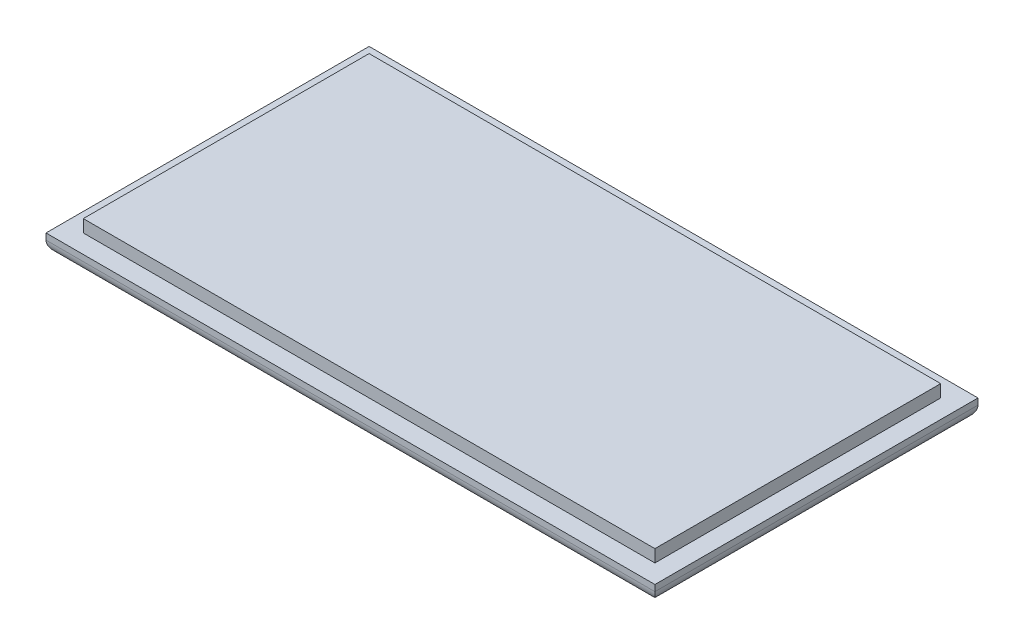
ISO-10303-21;
HEADER;
FILE_DESCRIPTION(('STEP AP214'),'2;1');
FILE_NAME('part.step','',(''),(''),'','','');
FILE_SCHEMA(('AUTOMOTIVE_DESIGN { 1 0 10303 214 1 1 1 1 }'));
ENDSEC;
DATA;
#1=APPLICATION_CONTEXT('core data for automotive mechanical design processes');
#2=APPLICATION_PROTOCOL_DEFINITION('international standard','automotive_design',2000,#1);
#3=PRODUCT_CONTEXT('',#1,'mechanical');
#4=PRODUCT('Part','Part','',(#3));
#5=PRODUCT_RELATED_PRODUCT_CATEGORY('part','',(#4));
#6=PRODUCT_DEFINITION_FORMATION('','',#4);
#7=PRODUCT_DEFINITION_CONTEXT('part definition',#1,'design');
#8=PRODUCT_DEFINITION('design','',#6,#7);
#9=PRODUCT_DEFINITION_SHAPE('','',#8);
#10=(LENGTH_UNIT() NAMED_UNIT(*) SI_UNIT(.MILLI.,.METRE.));
#11=(NAMED_UNIT(*) PLANE_ANGLE_UNIT() SI_UNIT($,.RADIAN.));
#12=(NAMED_UNIT(*) SI_UNIT($,.STERADIAN.) SOLID_ANGLE_UNIT());
#13=UNCERTAINTY_MEASURE_WITH_UNIT(LENGTH_MEASURE(1.E-05),#10,'distance_accuracy_value','');
#14=(GEOMETRIC_REPRESENTATION_CONTEXT(3) GLOBAL_UNCERTAINTY_ASSIGNED_CONTEXT((#13)) GLOBAL_UNIT_ASSIGNED_CONTEXT((#10,
#11,#12)) REPRESENTATION_CONTEXT('',''));
#15=CARTESIAN_POINT('',(0.,0.,0.));
#16=DIRECTION('',(0.,0.,1.));
#17=DIRECTION('',(1.,0.,0.));
#18=AXIS2_PLACEMENT_3D('',#15,#16,#17);
#19=CARTESIAN_POINT('',(24.5,1.5,-13.));
#20=DIRECTION('',(-1.,0.,0.));
#21=DIRECTION('',(0.,0.,1.));
#22=AXIS2_PLACEMENT_3D('',#19,#20,#21);
#23=PLANE('',#22);
#24=DIRECTION('',(0.,-1.,0.));
#25=VECTOR('',#24,1.);
#26=CARTESIAN_POINT('',(24.5,1.5,13.));
#27=LINE('',#26,#25);
#28=CARTESIAN_POINT('',(24.5,1.5,13.));
#29=VERTEX_POINT('',#28);
#30=CARTESIAN_POINT('',(24.5,1.,13.));
#31=VERTEX_POINT('',#30);
#32=EDGE_CURVE('E158',#29,#31,#27,.T.);
#33=ORIENTED_EDGE('',*,*,#32,.T.);
#34=DIRECTION('',(0.,0.,-1.));
#35=VECTOR('',#34,1.);
#36=CARTESIAN_POINT('',(24.5,1.,-13.));
#37=LINE('',#36,#35);
#38=CARTESIAN_POINT('',(24.5,1.,-13.));
#39=VERTEX_POINT('',#38);
#40=EDGE_CURVE('E11',#31,#39,#37,.T.);
#41=ORIENTED_EDGE('',*,*,#40,.T.);
#42=DIRECTION('',(0.,-1.,0.));
#43=VECTOR('',#42,1.);
#44=CARTESIAN_POINT('',(24.5,1.5,-13.));
#45=LINE('',#44,#43);
#46=CARTESIAN_POINT('',(24.5,1.5,-13.));
#47=VERTEX_POINT('',#46);
#48=EDGE_CURVE('E164',#47,#39,#45,.T.);
#49=ORIENTED_EDGE('',*,*,#48,.F.);
#50=DIRECTION('',(0.,0.,-1.));
#51=VECTOR('',#50,1.);
#52=CARTESIAN_POINT('',(24.5,1.5,-13.));
#53=LINE('',#52,#51);
#54=EDGE_CURVE('E144',#29,#47,#53,.T.);
#55=ORIENTED_EDGE('',*,*,#54,.F.);
#56=EDGE_LOOP('',(#33,#41,#49,#55));
#57=FACE_BOUND('',#56,.T.);
#58=ADVANCED_FACE('F39',(#57),#23,.F.);
#59=CARTESIAN_POINT('',(-24.5,1.5,-13.));
#60=DIRECTION('',(0.,0.,1.));
#61=DIRECTION('',(1.,0.,0.));
#62=AXIS2_PLACEMENT_3D('',#59,#60,#61);
#63=PLANE('',#62);
#64=ORIENTED_EDGE('',*,*,#48,.T.);
#65=DIRECTION('',(-1.,0.,0.));
#66=VECTOR('',#65,1.);
#67=CARTESIAN_POINT('',(-24.5,1.,-13.));
#68=LINE('',#67,#66);
#69=CARTESIAN_POINT('',(-24.5,1.,-13.));
#70=VERTEX_POINT('',#69);
#71=EDGE_CURVE('E167',#39,#70,#68,.T.);
#72=ORIENTED_EDGE('',*,*,#71,.T.);
#73=DIRECTION('',(0.,-1.,0.));
#74=VECTOR('',#73,1.);
#75=CARTESIAN_POINT('',(-24.5,1.5,-13.));
#76=LINE('',#75,#74);
#77=CARTESIAN_POINT('',(-24.5,1.5,-13.));
#78=VERTEX_POINT('',#77);
#79=EDGE_CURVE('E162',#78,#70,#76,.T.);
#80=ORIENTED_EDGE('',*,*,#79,.F.);
#81=DIRECTION('',(-1.,0.,0.));
#82=VECTOR('',#81,1.);
#83=CARTESIAN_POINT('',(-24.5,1.5,-13.));
#84=LINE('',#83,#82);
#85=EDGE_CURVE('E147',#47,#78,#84,.T.);
#86=ORIENTED_EDGE('',*,*,#85,.F.);
#87=EDGE_LOOP('',(#64,#72,#80,#86));
#88=FACE_BOUND('',#87,.T.);
#89=ADVANCED_FACE('F226',(#88),#63,.F.);
#90=CARTESIAN_POINT('',(-24.5,1.5,-13.));
#91=DIRECTION('',(1.,0.,0.));
#92=DIRECTION('',(0.,0.,-1.));
#93=AXIS2_PLACEMENT_3D('',#90,#91,#92);
#94=PLANE('',#93);
#95=ORIENTED_EDGE('',*,*,#79,.T.);
#96=DIRECTION('',(0.,0.,1.));
#97=VECTOR('',#96,1.);
#98=CARTESIAN_POINT('',(-24.5,1.,-13.));
#99=LINE('',#98,#97);
#100=CARTESIAN_POINT('',(-24.5,1.,13.));
#101=VERTEX_POINT('',#100);
#102=EDGE_CURVE('E63',#70,#101,#99,.T.);
#103=ORIENTED_EDGE('',*,*,#102,.T.);
#104=DIRECTION('',(0.,-1.,0.));
#105=VECTOR('',#104,1.);
#106=CARTESIAN_POINT('',(-24.5,1.5,13.));
#107=LINE('',#106,#105);
#108=CARTESIAN_POINT('',(-24.5,1.5,13.));
#109=VERTEX_POINT('',#108);
#110=EDGE_CURVE('E160',#109,#101,#107,.T.);
#111=ORIENTED_EDGE('',*,*,#110,.F.);
#112=DIRECTION('',(0.,0.,1.));
#113=VECTOR('',#112,1.);
#114=CARTESIAN_POINT('',(-24.5,1.5,-13.));
#115=LINE('',#114,#113);
#116=EDGE_CURVE('E154',#78,#109,#115,.T.);
#117=ORIENTED_EDGE('',*,*,#116,.F.);
#118=EDGE_LOOP('',(#95,#103,#111,#117));
#119=FACE_BOUND('',#118,.T.);
#120=ADVANCED_FACE('F247',(#119),#94,.F.);
#121=CARTESIAN_POINT('',(-24.5,1.5,13.));
#122=DIRECTION('',(0.,0.,-1.));
#123=DIRECTION('',(-1.,0.,0.));
#124=AXIS2_PLACEMENT_3D('',#121,#122,#123);
#125=PLANE('',#124);
#126=ORIENTED_EDGE('',*,*,#110,.T.);
#127=DIRECTION('',(1.,0.,0.));
#128=VECTOR('',#127,1.);
#129=CARTESIAN_POINT('',(-24.5,1.,13.));
#130=LINE('',#129,#128);
#131=EDGE_CURVE('E48',#101,#31,#130,.T.);
#132=ORIENTED_EDGE('',*,*,#131,.T.);
#133=ORIENTED_EDGE('',*,*,#32,.F.);
#134=DIRECTION('',(1.,0.,0.));
#135=VECTOR('',#134,1.);
#136=CARTESIAN_POINT('',(-24.5,1.5,13.));
#137=LINE('',#136,#135);
#138=EDGE_CURVE('E156',#109,#29,#137,.T.);
#139=ORIENTED_EDGE('',*,*,#138,.F.);
#140=EDGE_LOOP('',(#126,#132,#133,#139));
#141=FACE_BOUND('',#140,.T.);
#142=ADVANCED_FACE('F217',(#141),#125,.F.);
#143=CARTESIAN_POINT('',(0.,1.5,0.));
#144=DIRECTION('',(0.,1.,0.));
#145=DIRECTION('',(0.,0.,1.));
#146=AXIS2_PLACEMENT_3D('',#143,#144,#145);
#147=PLANE('',#146);
#148=DIRECTION('',(-1.,0.,0.));
#149=VECTOR('',#148,1.);
#150=CARTESIAN_POINT('',(-23.,1.5,-11.5));
#151=LINE('',#150,#149);
#152=CARTESIAN_POINT('',(23.,1.5,-11.5));
#153=VERTEX_POINT('',#152);
#154=CARTESIAN_POINT('',(-23.,1.5,-11.5));
#155=VERTEX_POINT('',#154);
#156=EDGE_CURVE('E143',#153,#155,#151,.T.);
#157=ORIENTED_EDGE('',*,*,#156,.F.);
#158=DIRECTION('',(0.,0.,-1.));
#159=VECTOR('',#158,1.);
#160=CARTESIAN_POINT('',(23.,1.5,-11.5));
#161=LINE('',#160,#159);
#162=CARTESIAN_POINT('',(23.,1.5,11.5));
#163=VERTEX_POINT('',#162);
#164=EDGE_CURVE('E140',#163,#153,#161,.T.);
#165=ORIENTED_EDGE('',*,*,#164,.F.);
#166=DIRECTION('',(1.,0.,0.));
#167=VECTOR('',#166,1.);
#168=CARTESIAN_POINT('',(-23.,1.5,11.5));
#169=LINE('',#168,#167);
#170=CARTESIAN_POINT('',(-23.,1.5,11.5));
#171=VERTEX_POINT('',#170);
#172=EDGE_CURVE('E196',#171,#163,#169,.T.);
#173=ORIENTED_EDGE('',*,*,#172,.F.);
#174=DIRECTION('',(0.,0.,1.));
#175=VECTOR('',#174,1.);
#176=CARTESIAN_POINT('',(-23.,1.5,-11.5));
#177=LINE('',#176,#175);
#178=EDGE_CURVE('E194',#155,#171,#177,.T.);
#179=ORIENTED_EDGE('',*,*,#178,.F.);
#180=EDGE_LOOP('',(#157,#165,#173,#179));
#181=FACE_BOUND('',#180,.T.);
#182=ORIENTED_EDGE('',*,*,#54,.T.);
#183=ORIENTED_EDGE('',*,*,#85,.T.);
#184=ORIENTED_EDGE('',*,*,#116,.T.);
#185=ORIENTED_EDGE('',*,*,#138,.T.);
#186=EDGE_LOOP('',(#182,#183,#184,#185));
#187=FACE_BOUND('',#186,.T.);
#188=ADVANCED_FACE('F213',(#181,#187),#147,.T.);
#189=CARTESIAN_POINT('',(0.,0.,0.));
#190=DIRECTION('',(0.,1.,0.));
#191=DIRECTION('',(0.,0.,1.));
#192=AXIS2_PLACEMENT_3D('',#189,#190,#191);
#193=PLANE('',#192);
#194=DIRECTION('',(0.,0.,1.));
#195=VECTOR('',#194,1.);
#196=CARTESIAN_POINT('',(-23.5,0.,0.));
#197=LINE('',#196,#195);
#198=CARTESIAN_POINT('',(-23.5,0.,12.));
#199=VERTEX_POINT('',#198);
#200=CARTESIAN_POINT('',(-23.5,0.,-12.));
#201=VERTEX_POINT('',#200);
#202=EDGE_CURVE('E174',#199,#201,#197,.F.);
#203=ORIENTED_EDGE('',*,*,#202,.T.);
#204=DIRECTION('',(-1.,0.,0.));
#205=VECTOR('',#204,1.);
#206=CARTESIAN_POINT('',(0.,0.,-12.));
#207=LINE('',#206,#205);
#208=CARTESIAN_POINT('',(23.5,0.,-12.));
#209=VERTEX_POINT('',#208);
#210=EDGE_CURVE('E176',#201,#209,#207,.F.);
#211=ORIENTED_EDGE('',*,*,#210,.T.);
#212=DIRECTION('',(0.,0.,-1.));
#213=VECTOR('',#212,1.);
#214=CARTESIAN_POINT('',(23.5,0.,0.));
#215=LINE('',#214,#213);
#216=CARTESIAN_POINT('',(23.5,0.,12.));
#217=VERTEX_POINT('',#216);
#218=EDGE_CURVE('E170',#209,#217,#215,.F.);
#219=ORIENTED_EDGE('',*,*,#218,.T.);
#220=DIRECTION('',(1.,0.,0.));
#221=VECTOR('',#220,1.);
#222=CARTESIAN_POINT('',(0.,0.,12.));
#223=LINE('',#222,#221);
#224=EDGE_CURVE('E172',#217,#199,#223,.F.);
#225=ORIENTED_EDGE('',*,*,#224,.T.);
#226=EDGE_LOOP('',(#203,#211,#219,#225));
#227=FACE_BOUND('',#226,.T.);
#228=ADVANCED_FACE('F216',(#227),#193,.F.);
#229=CARTESIAN_POINT('',(-23.,2.5,-11.5));
#230=DIRECTION('',(0.,0.,1.));
#231=DIRECTION('',(1.,0.,0.));
#232=AXIS2_PLACEMENT_3D('',#229,#230,#231);
#233=PLANE('',#232);
#234=ORIENTED_EDGE('',*,*,#156,.T.);
#235=DIRECTION('',(0.,-1.,0.));
#236=VECTOR('',#235,1.);
#237=CARTESIAN_POINT('',(-23.,2.5,-11.5));
#238=LINE('',#237,#236);
#239=CARTESIAN_POINT('',(-23.,2.5,-11.5));
#240=VERTEX_POINT('',#239);
#241=EDGE_CURVE('E124',#240,#155,#238,.T.);
#242=ORIENTED_EDGE('',*,*,#241,.F.);
#243=DIRECTION('',(-1.,0.,0.));
#244=VECTOR('',#243,1.);
#245=CARTESIAN_POINT('',(-23.,2.5,-11.5));
#246=LINE('',#245,#244);
#247=CARTESIAN_POINT('',(23.,2.5,-11.5));
#248=VERTEX_POINT('',#247);
#249=EDGE_CURVE('E131',#248,#240,#246,.T.);
#250=ORIENTED_EDGE('',*,*,#249,.F.);
#251=DIRECTION('',(0.,-1.,0.));
#252=VECTOR('',#251,1.);
#253=CARTESIAN_POINT('',(23.,2.5,-11.5));
#254=LINE('',#253,#252);
#255=EDGE_CURVE('E205',#248,#153,#254,.T.);
#256=ORIENTED_EDGE('',*,*,#255,.T.);
#257=EDGE_LOOP('',(#234,#242,#250,#256));
#258=FACE_BOUND('',#257,.T.);
#259=ADVANCED_FACE('F142',(#258),#233,.F.);
#260=CARTESIAN_POINT('',(-23.,2.5,-11.5));
#261=DIRECTION('',(1.,0.,0.));
#262=DIRECTION('',(0.,0.,-1.));
#263=AXIS2_PLACEMENT_3D('',#260,#261,#262);
#264=PLANE('',#263);
#265=ORIENTED_EDGE('',*,*,#178,.T.);
#266=DIRECTION('',(0.,-1.,0.));
#267=VECTOR('',#266,1.);
#268=CARTESIAN_POINT('',(-23.,2.5,11.5));
#269=LINE('',#268,#267);
#270=CARTESIAN_POINT('',(-23.,2.5,11.5));
#271=VERTEX_POINT('',#270);
#272=EDGE_CURVE('E127',#271,#171,#269,.T.);
#273=ORIENTED_EDGE('',*,*,#272,.F.);
#274=DIRECTION('',(0.,0.,1.));
#275=VECTOR('',#274,1.);
#276=CARTESIAN_POINT('',(-23.,2.5,-11.5));
#277=LINE('',#276,#275);
#278=EDGE_CURVE('E119',#240,#271,#277,.T.);
#279=ORIENTED_EDGE('',*,*,#278,.F.);
#280=ORIENTED_EDGE('',*,*,#241,.T.);
#281=EDGE_LOOP('',(#265,#273,#279,#280));
#282=FACE_BOUND('',#281,.T.);
#283=ADVANCED_FACE('F122',(#282),#264,.F.);
#284=CARTESIAN_POINT('',(-23.,2.5,11.5));
#285=DIRECTION('',(0.,0.,-1.));
#286=DIRECTION('',(-1.,0.,0.));
#287=AXIS2_PLACEMENT_3D('',#284,#285,#286);
#288=PLANE('',#287);
#289=ORIENTED_EDGE('',*,*,#172,.T.);
#290=DIRECTION('',(0.,-1.,0.));
#291=VECTOR('',#290,1.);
#292=CARTESIAN_POINT('',(23.,2.5,11.5));
#293=LINE('',#292,#291);
#294=CARTESIAN_POINT('',(23.,2.5,11.5));
#295=VERTEX_POINT('',#294);
#296=EDGE_CURVE('E149',#295,#163,#293,.T.);
#297=ORIENTED_EDGE('',*,*,#296,.F.);
#298=DIRECTION('',(1.,0.,0.));
#299=VECTOR('',#298,1.);
#300=CARTESIAN_POINT('',(-23.,2.5,11.5));
#301=LINE('',#300,#299);
#302=EDGE_CURVE('E130',#271,#295,#301,.T.);
#303=ORIENTED_EDGE('',*,*,#302,.F.);
#304=ORIENTED_EDGE('',*,*,#272,.T.);
#305=EDGE_LOOP('',(#289,#297,#303,#304));
#306=FACE_BOUND('',#305,.T.);
#307=ADVANCED_FACE('F211',(#306),#288,.F.);
#308=CARTESIAN_POINT('',(23.,2.5,-11.5));
#309=DIRECTION('',(-1.,0.,0.));
#310=DIRECTION('',(0.,0.,1.));
#311=AXIS2_PLACEMENT_3D('',#308,#309,#310);
#312=PLANE('',#311);
#313=ORIENTED_EDGE('',*,*,#164,.T.);
#314=ORIENTED_EDGE('',*,*,#255,.F.);
#315=DIRECTION('',(0.,0.,-1.));
#316=VECTOR('',#315,1.);
#317=CARTESIAN_POINT('',(23.,2.5,-11.5));
#318=LINE('',#317,#316);
#319=EDGE_CURVE('E136',#295,#248,#318,.T.);
#320=ORIENTED_EDGE('',*,*,#319,.F.);
#321=ORIENTED_EDGE('',*,*,#296,.T.);
#322=EDGE_LOOP('',(#313,#314,#320,#321));
#323=FACE_BOUND('',#322,.T.);
#324=ADVANCED_FACE('F209',(#323),#312,.F.);
#325=CARTESIAN_POINT('',(0.,2.5,0.));
#326=DIRECTION('',(0.,-1.,0.));
#327=DIRECTION('',(0.,0.,-1.));
#328=AXIS2_PLACEMENT_3D('',#325,#326,#327);
#329=PLANE('',#328);
#330=ORIENTED_EDGE('',*,*,#249,.T.);
#331=ORIENTED_EDGE('',*,*,#278,.T.);
#332=ORIENTED_EDGE('',*,*,#302,.T.);
#333=ORIENTED_EDGE('',*,*,#319,.T.);
#334=EDGE_LOOP('',(#330,#331,#332,#333));
#335=FACE_BOUND('',#334,.T.);
#336=ADVANCED_FACE('F134',(#335),#329,.F.);
#337=CARTESIAN_POINT('',(-24.5,1.,12.));
#338=DIRECTION('',(1.,0.,0.));
#339=DIRECTION('',(0.,0.,-1.));
#340=AXIS2_PLACEMENT_3D('',#337,#338,#339);
#341=CYLINDRICAL_SURFACE('',#340,1.);
#342=CARTESIAN_POINT('',(-23.5,1.,12.));
#343=DIRECTION('',(0.707106781186547,0.,0.707106781186547));
#344=DIRECTION('',(0.707106781186547,0.,-0.707106781186547));
#345=AXIS2_PLACEMENT_3D('',#342,#343,#344);
#346=ELLIPSE('',#345,1.41421356237309,1.);
#347=EDGE_CURVE('E184',#199,#101,#346,.F.);
#348=ORIENTED_EDGE('',*,*,#347,.F.);
#349=ORIENTED_EDGE('',*,*,#224,.F.);
#350=CARTESIAN_POINT('',(23.5,1.,12.));
#351=DIRECTION('',(0.707106781186547,0.,-0.707106781186547));
#352=DIRECTION('',(-0.707106781186547,0.,-0.707106781186547));
#353=AXIS2_PLACEMENT_3D('',#350,#351,#352);
#354=ELLIPSE('',#353,1.41421356237309,1.);
#355=EDGE_CURVE('E43',#31,#217,#354,.T.);
#356=ORIENTED_EDGE('',*,*,#355,.F.);
#357=ORIENTED_EDGE('',*,*,#131,.F.);
#358=EDGE_LOOP('',(#348,#349,#356,#357));
#359=FACE_BOUND('',#358,.T.);
#360=ADVANCED_FACE('F41',(#359),#341,.T.);
#361=CARTESIAN_POINT('',(23.5,1.,-13.));
#362=DIRECTION('',(0.,0.,-1.));
#363=DIRECTION('',(-1.,0.,0.));
#364=AXIS2_PLACEMENT_3D('',#361,#362,#363);
#365=CYLINDRICAL_SURFACE('',#364,1.);
#366=ORIENTED_EDGE('',*,*,#355,.T.);
#367=ORIENTED_EDGE('',*,*,#218,.F.);
#368=CARTESIAN_POINT('',(23.5,1.,-12.));
#369=DIRECTION('',(-0.707106781186547,0.,-0.707106781186547));
#370=DIRECTION('',(0.707106781186547,0.,-0.707106781186547));
#371=AXIS2_PLACEMENT_3D('',#368,#369,#370);
#372=ELLIPSE('',#371,1.41421356237309,1.);
#373=EDGE_CURVE('E183',#39,#209,#372,.T.);
#374=ORIENTED_EDGE('',*,*,#373,.F.);
#375=ORIENTED_EDGE('',*,*,#40,.F.);
#376=EDGE_LOOP('',(#366,#367,#374,#375));
#377=FACE_BOUND('',#376,.T.);
#378=ADVANCED_FACE('F228',(#377),#365,.T.);
#379=CARTESIAN_POINT('',(-23.5,1.,-13.));
#380=DIRECTION('',(0.,0.,1.));
#381=DIRECTION('',(1.,0.,0.));
#382=AXIS2_PLACEMENT_3D('',#379,#380,#381);
#383=CYLINDRICAL_SURFACE('',#382,1.);
#384=ORIENTED_EDGE('',*,*,#347,.T.);
#385=ORIENTED_EDGE('',*,*,#102,.F.);
#386=CARTESIAN_POINT('',(-23.5,1.,-12.));
#387=DIRECTION('',(-0.707106781186547,0.,0.707106781186547));
#388=DIRECTION('',(0.707106781186547,0.,0.707106781186547));
#389=AXIS2_PLACEMENT_3D('',#386,#387,#388);
#390=ELLIPSE('',#389,1.41421356237309,1.);
#391=EDGE_CURVE('E181',#201,#70,#390,.F.);
#392=ORIENTED_EDGE('',*,*,#391,.F.);
#393=ORIENTED_EDGE('',*,*,#202,.F.);
#394=EDGE_LOOP('',(#384,#385,#392,#393));
#395=FACE_BOUND('',#394,.T.);
#396=ADVANCED_FACE('F233',(#395),#383,.T.);
#397=CARTESIAN_POINT('',(-24.5,1.,-12.));
#398=DIRECTION('',(-1.,0.,0.));
#399=DIRECTION('',(0.,0.,1.));
#400=AXIS2_PLACEMENT_3D('',#397,#398,#399);
#401=CYLINDRICAL_SURFACE('',#400,1.);
#402=ORIENTED_EDGE('',*,*,#373,.T.);
#403=ORIENTED_EDGE('',*,*,#210,.F.);
#404=ORIENTED_EDGE('',*,*,#391,.T.);
#405=ORIENTED_EDGE('',*,*,#71,.F.);
#406=EDGE_LOOP('',(#402,#403,#404,#405));
#407=FACE_BOUND('',#406,.T.);
#408=ADVANCED_FACE('F231',(#407),#401,.T.);
#409=CLOSED_SHELL('',(#58,#89,#120,#142,#188,#228,#259,#283,#307,#324,#336,#360,#378,#396,#408));
#410=MANIFOLD_SOLID_BREP('B2',#409);
#411=ADVANCED_BREP_SHAPE_REPRESENTATION('',(#18,#410),#14);
#412=SHAPE_DEFINITION_REPRESENTATION(#9,#411);
ENDSEC;
END-ISO-10303-21;
